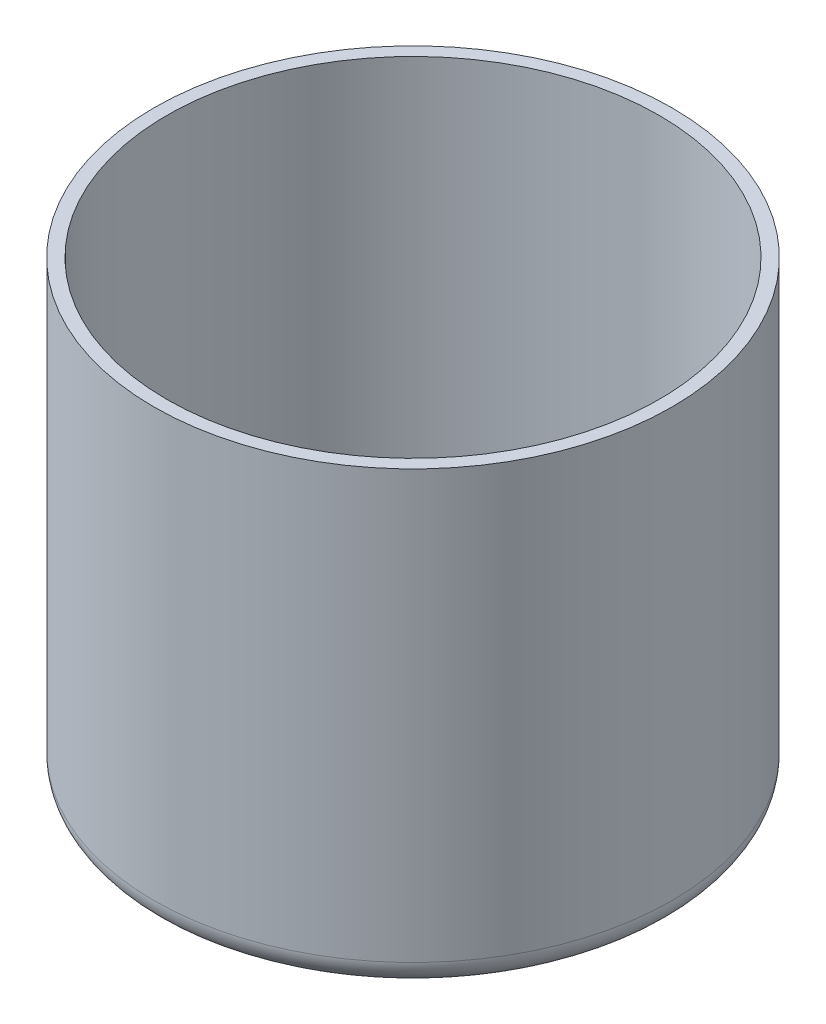
ISO-10303-21;
HEADER;
FILE_DESCRIPTION(('STEP AP214'),'2;1');
FILE_NAME('part.step','',(''),(''),'','','');
FILE_SCHEMA(('AUTOMOTIVE_DESIGN { 1 0 10303 214 1 1 1 1 }'));
ENDSEC;
DATA;
#1=APPLICATION_CONTEXT('core data for automotive mechanical design processes');
#2=APPLICATION_PROTOCOL_DEFINITION('international standard','automotive_design',2000,#1);
#3=PRODUCT_CONTEXT('',#1,'mechanical');
#4=PRODUCT('Part','Part','',(#3));
#5=PRODUCT_RELATED_PRODUCT_CATEGORY('part','',(#4));
#6=PRODUCT_DEFINITION_FORMATION('','',#4);
#7=PRODUCT_DEFINITION_CONTEXT('part definition',#1,'design');
#8=PRODUCT_DEFINITION('design','',#6,#7);
#9=PRODUCT_DEFINITION_SHAPE('','',#8);
#10=(LENGTH_UNIT() NAMED_UNIT(*) SI_UNIT(.MILLI.,.METRE.));
#11=(NAMED_UNIT(*) PLANE_ANGLE_UNIT() SI_UNIT($,.RADIAN.));
#12=(NAMED_UNIT(*) SI_UNIT($,.STERADIAN.) SOLID_ANGLE_UNIT());
#13=UNCERTAINTY_MEASURE_WITH_UNIT(LENGTH_MEASURE(1.E-05),#10,'distance_accuracy_value','');
#14=(GEOMETRIC_REPRESENTATION_CONTEXT(3) GLOBAL_UNCERTAINTY_ASSIGNED_CONTEXT((#13)) GLOBAL_UNIT_ASSIGNED_CONTEXT((#10,
#11,#12)) REPRESENTATION_CONTEXT('',''));
#15=CARTESIAN_POINT('',(0.,0.,0.));
#16=DIRECTION('',(0.,0.,1.));
#17=DIRECTION('',(1.,0.,0.));
#18=AXIS2_PLACEMENT_3D('',#15,#16,#17);
#19=CARTESIAN_POINT('',(-20.,2.42320141630249,0.));
#20=DIRECTION('',(0.,-1.,0.));
#21=DIRECTION('',(0.,0.,-1.));
#22=AXIS2_PLACEMENT_3D('',#19,#20,#21);
#23=PLANE('',#22);
#24=CARTESIAN_POINT('',(0.,2.42320141630249,0.));
#25=DIRECTION('',(0.,-1.,0.));
#26=DIRECTION('',(0.,0.,-1.));
#27=AXIS2_PLACEMENT_3D('',#24,#25,#26);
#28=CIRCLE('',#27,20.);
#29=CARTESIAN_POINT('',(0.,2.42320141630249,-20.));
#30=VERTEX_POINT('',#29);
#31=EDGE_CURVE('E61',#30,#30,#28,.T.);
#32=ORIENTED_EDGE('',*,*,#31,.F.);
#33=EDGE_LOOP('',(#32));
#34=FACE_BOUND('',#33,.T.);
#35=CARTESIAN_POINT('',(0.,2.42320141630249,0.));
#36=DIRECTION('',(0.,-1.,0.));
#37=DIRECTION('',(0.,0.,-1.));
#38=AXIS2_PLACEMENT_3D('',#35,#36,#37);
#39=CIRCLE('',#38,19.);
#40=CARTESIAN_POINT('',(0.,2.42320141630249,-19.));
#41=VERTEX_POINT('',#40);
#42=EDGE_CURVE('E50',#41,#41,#39,.T.);
#43=ORIENTED_EDGE('',*,*,#42,.T.);
#44=EDGE_LOOP('',(#43));
#45=FACE_BOUND('',#44,.T.);
#46=ADVANCED_FACE('F37',(#34,#45),#23,.F.);
#47=CARTESIAN_POINT('',(0.,3.57353036051222E-12,0.));
#48=DIRECTION('',(0.,-1.,0.));
#49=DIRECTION('',(0.,0.,-1.));
#50=AXIS2_PLACEMENT_3D('',#47,#48,#49);
#51=CYLINDRICAL_SURFACE('',#50,19.);
#52=ORIENTED_EDGE('',*,*,#42,.F.);
#53=EDGE_LOOP('',(#52));
#54=FACE_BOUND('',#53,.T.);
#55=CARTESIAN_POINT('',(0.,-31.5767985836975,0.));
#56=DIRECTION('',(0.,-1.,0.));
#57=DIRECTION('',(0.,0.,-1.));
#58=AXIS2_PLACEMENT_3D('',#55,#56,#57);
#59=CIRCLE('',#58,19.);
#60=CARTESIAN_POINT('',(0.,-31.5767985836975,-19.));
#61=VERTEX_POINT('',#60);
#62=EDGE_CURVE('E55',#61,#61,#59,.T.);
#63=ORIENTED_EDGE('',*,*,#62,.T.);
#64=EDGE_LOOP('',(#63));
#65=FACE_BOUND('',#64,.T.);
#66=ADVANCED_FACE('F70',(#54,#65),#51,.F.);
#67=CARTESIAN_POINT('',(-19.,-31.5767985836975,0.));
#68=DIRECTION('',(0.,-1.,0.));
#69=DIRECTION('',(0.,0.,-1.));
#70=AXIS2_PLACEMENT_3D('',#67,#68,#69);
#71=PLANE('',#70);
#72=ORIENTED_EDGE('',*,*,#62,.F.);
#73=EDGE_LOOP('',(#72));
#74=FACE_BOUND('',#73,.T.);
#75=ADVANCED_FACE('F75',(#74),#71,.F.);
#76=CARTESIAN_POINT('',(-20.,-32.5767985836975,0.));
#77=DIRECTION('',(0.,1.,0.));
#78=DIRECTION('',(0.,0.,1.));
#79=AXIS2_PLACEMENT_3D('',#76,#77,#78);
#80=PLANE('',#79);
#81=CARTESIAN_POINT('',(0.,-32.5767985836975,0.));
#82=DIRECTION('',(0.,1.,0.));
#83=DIRECTION('',(0.,0.,1.));
#84=AXIS2_PLACEMENT_3D('',#81,#82,#83);
#85=CIRCLE('',#84,18.);
#86=CARTESIAN_POINT('',(0.,-32.5767985836975,18.));
#87=VERTEX_POINT('',#86);
#88=EDGE_CURVE('E45',#87,#87,#85,.F.);
#89=ORIENTED_EDGE('',*,*,#88,.T.);
#90=EDGE_LOOP('',(#89));
#91=FACE_BOUND('',#90,.T.);
#92=ADVANCED_FACE('F80',(#91),#80,.F.);
#93=CARTESIAN_POINT('',(0.,3.57353036051222E-12,0.));
#94=DIRECTION('',(0.,-1.,0.));
#95=DIRECTION('',(0.,0.,-1.));
#96=AXIS2_PLACEMENT_3D('',#93,#94,#95);
#97=CYLINDRICAL_SURFACE('',#96,20.);
#98=CARTESIAN_POINT('',(0.,-30.5767985836975,0.));
#99=DIRECTION('',(0.,1.,0.));
#100=DIRECTION('',(0.,0.,1.));
#101=AXIS2_PLACEMENT_3D('',#98,#99,#100);
#102=CIRCLE('',#101,20.);
#103=CARTESIAN_POINT('',(0.,-30.5767985836975,20.));
#104=VERTEX_POINT('',#103);
#105=EDGE_CURVE('E10',#104,#104,#102,.T.);
#106=ORIENTED_EDGE('',*,*,#105,.T.);
#107=EDGE_LOOP('',(#106));
#108=FACE_BOUND('',#107,.T.);
#109=ORIENTED_EDGE('',*,*,#31,.T.);
#110=EDGE_LOOP('',(#109));
#111=FACE_BOUND('',#110,.T.);
#112=ADVANCED_FACE('F66',(#108,#111),#97,.T.);
#113=CARTESIAN_POINT('',(0.,-30.5767985836975,0.));
#114=DIRECTION('',(0.,1.,0.));
#115=DIRECTION('',(0.,0.,1.));
#116=AXIS2_PLACEMENT_3D('',#113,#114,#115);
#117=TOROIDAL_SURFACE('',#116,18.,2.);
#118=ORIENTED_EDGE('',*,*,#105,.F.);
#119=EDGE_LOOP('',(#118));
#120=FACE_BOUND('',#119,.T.);
#121=ORIENTED_EDGE('',*,*,#88,.F.);
#122=EDGE_LOOP('',(#121));
#123=FACE_BOUND('',#122,.T.);
#124=ADVANCED_FACE('F39',(#120,#123),#117,.T.);
#125=CLOSED_SHELL('',(#46,#66,#75,#92,#112,#124));
#126=MANIFOLD_SOLID_BREP('B2',#125);
#127=ADVANCED_BREP_SHAPE_REPRESENTATION('',(#18,#126),#14);
#128=SHAPE_DEFINITION_REPRESENTATION(#9,#127);
ENDSEC;
END-ISO-10303-21;
